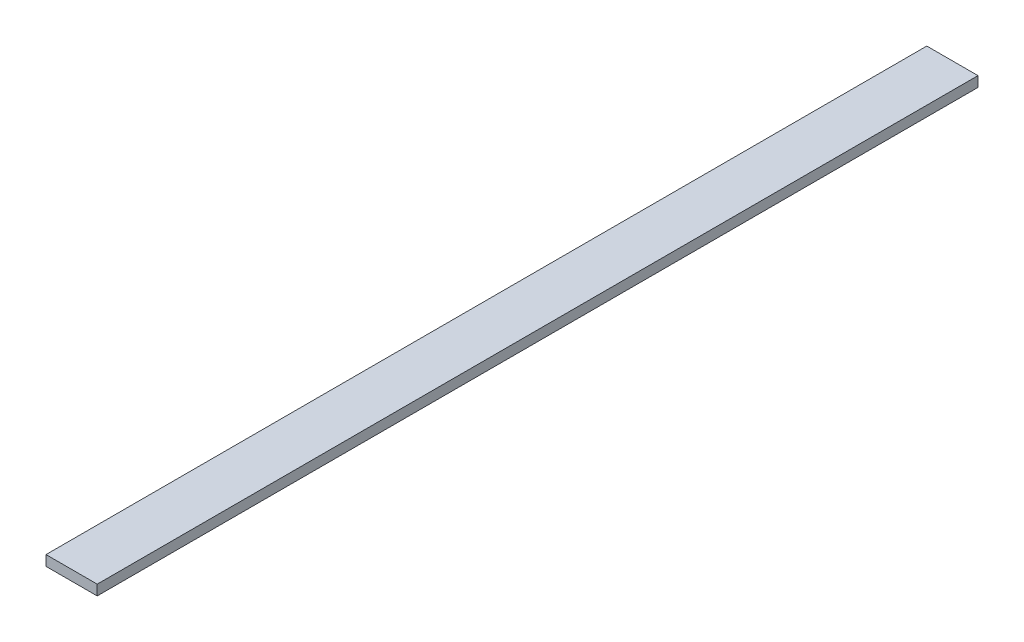
ISO-10303-21;
HEADER;
FILE_DESCRIPTION(('STEP AP214'),'2;1');
FILE_NAME('part.step','',(''),(''),'','','');
FILE_SCHEMA(('AUTOMOTIVE_DESIGN { 1 0 10303 214 1 1 1 1 }'));
ENDSEC;
DATA;
#1=APPLICATION_CONTEXT('core data for automotive mechanical design processes');
#2=APPLICATION_PROTOCOL_DEFINITION('international standard','automotive_design',2000,#1);
#3=PRODUCT_CONTEXT('',#1,'mechanical');
#4=PRODUCT('Part','Part','',(#3));
#5=PRODUCT_RELATED_PRODUCT_CATEGORY('part','',(#4));
#6=PRODUCT_DEFINITION_FORMATION('','',#4);
#7=PRODUCT_DEFINITION_CONTEXT('part definition',#1,'design');
#8=PRODUCT_DEFINITION('design','',#6,#7);
#9=PRODUCT_DEFINITION_SHAPE('','',#8);
#10=(LENGTH_UNIT() NAMED_UNIT(*) SI_UNIT(.MILLI.,.METRE.));
#11=(NAMED_UNIT(*) PLANE_ANGLE_UNIT() SI_UNIT($,.RADIAN.));
#12=(NAMED_UNIT(*) SI_UNIT($,.STERADIAN.) SOLID_ANGLE_UNIT());
#13=UNCERTAINTY_MEASURE_WITH_UNIT(LENGTH_MEASURE(1.E-05),#10,'distance_accuracy_value','');
#14=(GEOMETRIC_REPRESENTATION_CONTEXT(3) GLOBAL_UNCERTAINTY_ASSIGNED_CONTEXT((#13)) GLOBAL_UNIT_ASSIGNED_CONTEXT((#10,
#11,#12)) REPRESENTATION_CONTEXT('',''));
#15=CARTESIAN_POINT('',(0.,0.,0.));
#16=DIRECTION('',(0.,0.,1.));
#17=DIRECTION('',(1.,0.,0.));
#18=AXIS2_PLACEMENT_3D('',#15,#16,#17);
#19=CARTESIAN_POINT('',(0.,10.,-860.));
#20=DIRECTION('',(1.,0.,0.));
#21=DIRECTION('',(0.,0.,-1.));
#22=AXIS2_PLACEMENT_3D('',#19,#20,#21);
#23=PLANE('',#22);
#24=DIRECTION('',(0.,0.,1.));
#25=VECTOR('',#24,1.);
#26=CARTESIAN_POINT('',(0.,0.,-860.));
#27=LINE('',#26,#25);
#28=CARTESIAN_POINT('',(0.,0.,-860.));
#29=VERTEX_POINT('',#28);
#30=CARTESIAN_POINT('',(0.,0.,0.));
#31=VERTEX_POINT('',#30);
#32=EDGE_CURVE('E107',#29,#31,#27,.T.);
#33=ORIENTED_EDGE('',*,*,#32,.T.);
#34=DIRECTION('',(0.,-1.,0.));
#35=VECTOR('',#34,1.);
#36=CARTESIAN_POINT('',(0.,10.,0.));
#37=LINE('',#36,#35);
#38=CARTESIAN_POINT('',(0.,10.,0.));
#39=VERTEX_POINT('',#38);
#40=EDGE_CURVE('E11',#39,#31,#37,.T.);
#41=ORIENTED_EDGE('',*,*,#40,.F.);
#42=DIRECTION('',(0.,0.,1.));
#43=VECTOR('',#42,1.);
#44=CARTESIAN_POINT('',(0.,10.,-860.));
#45=LINE('',#44,#43);
#46=CARTESIAN_POINT('',(0.,10.,-860.));
#47=VERTEX_POINT('',#46);
#48=EDGE_CURVE('E91',#47,#39,#45,.T.);
#49=ORIENTED_EDGE('',*,*,#48,.F.);
#50=DIRECTION('',(0.,-1.,0.));
#51=VECTOR('',#50,1.);
#52=CARTESIAN_POINT('',(0.,10.,-860.));
#53=LINE('',#52,#51);
#54=EDGE_CURVE('E103',#47,#29,#53,.T.);
#55=ORIENTED_EDGE('',*,*,#54,.T.);
#56=EDGE_LOOP('',(#33,#41,#49,#55));
#57=FACE_BOUND('',#56,.T.);
#58=ADVANCED_FACE('F39',(#57),#23,.F.);
#59=CARTESIAN_POINT('',(0.,10.,0.));
#60=DIRECTION('',(0.,0.,-1.));
#61=DIRECTION('',(-1.,0.,0.));
#62=AXIS2_PLACEMENT_3D('',#59,#60,#61);
#63=PLANE('',#62);
#64=DIRECTION('',(1.,0.,0.));
#65=VECTOR('',#64,1.);
#66=CARTESIAN_POINT('',(0.,0.,0.));
#67=LINE('',#66,#65);
#68=CARTESIAN_POINT('',(50.,0.,0.));
#69=VERTEX_POINT('',#68);
#70=EDGE_CURVE('E96',#31,#69,#67,.T.);
#71=ORIENTED_EDGE('',*,*,#70,.T.);
#72=DIRECTION('',(0.,-1.,0.));
#73=VECTOR('',#72,1.);
#74=CARTESIAN_POINT('',(50.,10.,0.));
#75=LINE('',#74,#73);
#76=CARTESIAN_POINT('',(50.,10.,0.));
#77=VERTEX_POINT('',#76);
#78=EDGE_CURVE('E48',#77,#69,#75,.T.);
#79=ORIENTED_EDGE('',*,*,#78,.F.);
#80=DIRECTION('',(1.,0.,0.));
#81=VECTOR('',#80,1.);
#82=CARTESIAN_POINT('',(0.,10.,0.));
#83=LINE('',#82,#81);
#84=EDGE_CURVE('E86',#39,#77,#83,.T.);
#85=ORIENTED_EDGE('',*,*,#84,.F.);
#86=ORIENTED_EDGE('',*,*,#40,.T.);
#87=EDGE_LOOP('',(#71,#79,#85,#86));
#88=FACE_BOUND('',#87,.T.);
#89=ADVANCED_FACE('F95',(#88),#63,.F.);
#90=CARTESIAN_POINT('',(50.,10.,0.));
#91=DIRECTION('',(-1.,0.,0.));
#92=DIRECTION('',(0.,0.,1.));
#93=AXIS2_PLACEMENT_3D('',#90,#91,#92);
#94=PLANE('',#93);
#95=DIRECTION('',(0.,0.,-1.));
#96=VECTOR('',#95,1.);
#97=CARTESIAN_POINT('',(50.,0.,0.));
#98=LINE('',#97,#96);
#99=CARTESIAN_POINT('',(50.,0.,-860.));
#100=VERTEX_POINT('',#99);
#101=EDGE_CURVE('E73',#69,#100,#98,.T.);
#102=ORIENTED_EDGE('',*,*,#101,.T.);
#103=DIRECTION('',(0.,-1.,0.));
#104=VECTOR('',#103,1.);
#105=CARTESIAN_POINT('',(50.,10.,-860.));
#106=LINE('',#105,#104);
#107=CARTESIAN_POINT('',(50.,10.,-860.));
#108=VERTEX_POINT('',#107);
#109=EDGE_CURVE('E98',#108,#100,#106,.T.);
#110=ORIENTED_EDGE('',*,*,#109,.F.);
#111=DIRECTION('',(0.,0.,-1.));
#112=VECTOR('',#111,1.);
#113=CARTESIAN_POINT('',(50.,10.,0.));
#114=LINE('',#113,#112);
#115=EDGE_CURVE('E89',#77,#108,#114,.T.);
#116=ORIENTED_EDGE('',*,*,#115,.F.);
#117=ORIENTED_EDGE('',*,*,#78,.T.);
#118=EDGE_LOOP('',(#102,#110,#116,#117));
#119=FACE_BOUND('',#118,.T.);
#120=ADVANCED_FACE('F99',(#119),#94,.F.);
#121=CARTESIAN_POINT('',(50.,10.,-860.));
#122=DIRECTION('',(0.,0.,1.));
#123=DIRECTION('',(1.,0.,0.));
#124=AXIS2_PLACEMENT_3D('',#121,#122,#123);
#125=PLANE('',#124);
#126=DIRECTION('',(-1.,0.,0.));
#127=VECTOR('',#126,1.);
#128=CARTESIAN_POINT('',(50.,0.,-860.));
#129=LINE('',#128,#127);
#130=EDGE_CURVE('E79',#100,#29,#129,.T.);
#131=ORIENTED_EDGE('',*,*,#130,.T.);
#132=ORIENTED_EDGE('',*,*,#54,.F.);
#133=DIRECTION('',(-1.,0.,0.));
#134=VECTOR('',#133,1.);
#135=CARTESIAN_POINT('',(50.,10.,-860.));
#136=LINE('',#135,#134);
#137=EDGE_CURVE('E56',#108,#47,#136,.T.);
#138=ORIENTED_EDGE('',*,*,#137,.F.);
#139=ORIENTED_EDGE('',*,*,#109,.T.);
#140=EDGE_LOOP('',(#131,#132,#138,#139));
#141=FACE_BOUND('',#140,.T.);
#142=ADVANCED_FACE('F120',(#141),#125,.F.);
#143=CARTESIAN_POINT('',(0.,10.,0.));
#144=DIRECTION('',(0.,1.,0.));
#145=DIRECTION('',(0.,0.,1.));
#146=AXIS2_PLACEMENT_3D('',#143,#144,#145);
#147=PLANE('',#146);
#148=ORIENTED_EDGE('',*,*,#48,.T.);
#149=ORIENTED_EDGE('',*,*,#84,.T.);
#150=ORIENTED_EDGE('',*,*,#115,.T.);
#151=ORIENTED_EDGE('',*,*,#137,.T.);
#152=EDGE_LOOP('',(#148,#149,#150,#151));
#153=FACE_BOUND('',#152,.T.);
#154=ADVANCED_FACE('F87',(#153),#147,.T.);
#155=CARTESIAN_POINT('',(0.,0.,0.));
#156=DIRECTION('',(0.,1.,0.));
#157=DIRECTION('',(0.,0.,1.));
#158=AXIS2_PLACEMENT_3D('',#155,#156,#157);
#159=PLANE('',#158);
#160=ORIENTED_EDGE('',*,*,#32,.F.);
#161=ORIENTED_EDGE('',*,*,#130,.F.);
#162=ORIENTED_EDGE('',*,*,#101,.F.);
#163=ORIENTED_EDGE('',*,*,#70,.F.);
#164=EDGE_LOOP('',(#160,#161,#162,#163));
#165=FACE_BOUND('',#164,.T.);
#166=ADVANCED_FACE('F123',(#165),#159,.F.);
#167=CLOSED_SHELL('',(#58,#89,#120,#142,#154,#166));
#168=MANIFOLD_SOLID_BREP('B2',#167);
#169=ADVANCED_BREP_SHAPE_REPRESENTATION('',(#18,#168),#14);
#170=SHAPE_DEFINITION_REPRESENTATION(#9,#169);
ENDSEC;
END-ISO-10303-21;
